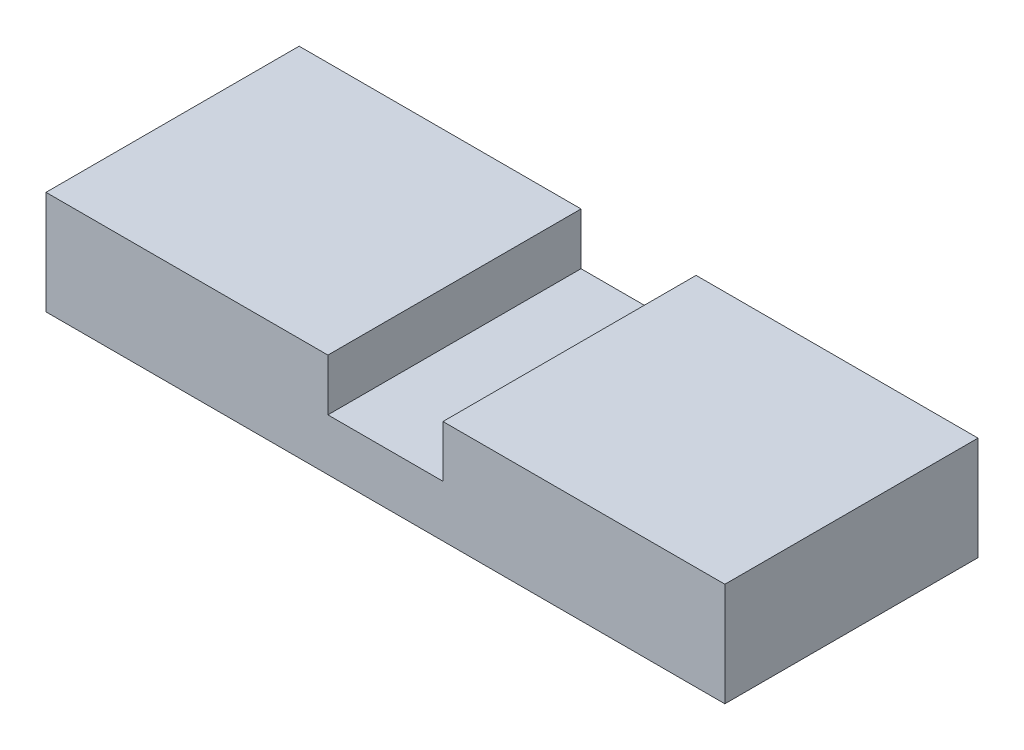
ISO-10303-21;
HEADER;
FILE_DESCRIPTION(('STEP AP214'),'2;1');
FILE_NAME('part.step','',(''),(''),'','','');
FILE_SCHEMA(('AUTOMOTIVE_DESIGN { 1 0 10303 214 1 1 1 1 }'));
ENDSEC;
DATA;
#1=APPLICATION_CONTEXT('core data for automotive mechanical design processes');
#2=APPLICATION_PROTOCOL_DEFINITION('international standard','automotive_design',2000,#1);
#3=PRODUCT_CONTEXT('',#1,'mechanical');
#4=PRODUCT('Part','Part','',(#3));
#5=PRODUCT_RELATED_PRODUCT_CATEGORY('part','',(#4));
#6=PRODUCT_DEFINITION_FORMATION('','',#4);
#7=PRODUCT_DEFINITION_CONTEXT('part definition',#1,'design');
#8=PRODUCT_DEFINITION('design','',#6,#7);
#9=PRODUCT_DEFINITION_SHAPE('','',#8);
#10=(LENGTH_UNIT() NAMED_UNIT(*) SI_UNIT(.MILLI.,.METRE.));
#11=(NAMED_UNIT(*) PLANE_ANGLE_UNIT() SI_UNIT($,.RADIAN.));
#12=(NAMED_UNIT(*) SI_UNIT($,.STERADIAN.) SOLID_ANGLE_UNIT());
#13=UNCERTAINTY_MEASURE_WITH_UNIT(LENGTH_MEASURE(1.E-05),#10,'distance_accuracy_value','');
#14=(GEOMETRIC_REPRESENTATION_CONTEXT(3) GLOBAL_UNCERTAINTY_ASSIGNED_CONTEXT((#13)) GLOBAL_UNIT_ASSIGNED_CONTEXT((#10,
#11,#12)) REPRESENTATION_CONTEXT('',''));
#15=CARTESIAN_POINT('',(0.,0.,0.));
#16=DIRECTION('',(0.,0.,1.));
#17=DIRECTION('',(1.,0.,0.));
#18=AXIS2_PLACEMENT_3D('',#15,#16,#17);
#19=CARTESIAN_POINT('',(-59.,9.,-22.));
#20=DIRECTION('',(0.,1.,0.));
#21=DIRECTION('',(0.,0.,1.));
#22=AXIS2_PLACEMENT_3D('',#19,#20,#21);
#23=PLANE('',#22);
#24=DIRECTION('',(0.,0.,1.));
#25=VECTOR('',#24,1.);
#26=CARTESIAN_POINT('',(-10.,9.,22.));
#27=LINE('',#26,#25);
#28=CARTESIAN_POINT('',(-10.,9.,-22.));
#29=VERTEX_POINT('',#28);
#30=CARTESIAN_POINT('',(-10.,9.,22.));
#31=VERTEX_POINT('',#30);
#32=EDGE_CURVE('E109',#29,#31,#27,.T.);
#33=ORIENTED_EDGE('',*,*,#32,.F.);
#34=DIRECTION('',(-1.,0.,0.));
#35=VECTOR('',#34,1.);
#36=CARTESIAN_POINT('',(59.,9.,-22.));
#37=LINE('',#36,#35);
#38=CARTESIAN_POINT('',(-59.,9.,-22.));
#39=VERTEX_POINT('',#38);
#40=EDGE_CURVE('E54',#29,#39,#37,.T.);
#41=ORIENTED_EDGE('',*,*,#40,.T.);
#42=DIRECTION('',(0.,0.,1.));
#43=VECTOR('',#42,1.);
#44=CARTESIAN_POINT('',(-59.,9.,22.));
#45=LINE('',#44,#43);
#46=CARTESIAN_POINT('',(-59.,9.,22.));
#47=VERTEX_POINT('',#46);
#48=EDGE_CURVE('E138',#39,#47,#45,.T.);
#49=ORIENTED_EDGE('',*,*,#48,.T.);
#50=DIRECTION('',(1.,0.,0.));
#51=VECTOR('',#50,1.);
#52=CARTESIAN_POINT('',(59.,9.,22.));
#53=LINE('',#52,#51);
#54=EDGE_CURVE('E83',#47,#31,#53,.T.);
#55=ORIENTED_EDGE('',*,*,#54,.T.);
#56=EDGE_LOOP('',(#33,#41,#49,#55));
#57=FACE_BOUND('',#56,.T.);
#58=ADVANCED_FACE('F30',(#57),#23,.T.);
#59=CARTESIAN_POINT('',(-59.,9.,22.));
#60=DIRECTION('',(1.,0.,0.));
#61=DIRECTION('',(0.,0.,-1.));
#62=AXIS2_PLACEMENT_3D('',#59,#60,#61);
#63=PLANE('',#62);
#64=DIRECTION('',(0.,0.,1.));
#65=VECTOR('',#64,1.);
#66=CARTESIAN_POINT('',(-59.,-9.,22.));
#67=LINE('',#66,#65);
#68=CARTESIAN_POINT('',(-59.,-9.,-22.));
#69=VERTEX_POINT('',#68);
#70=CARTESIAN_POINT('',(-59.,-9.,22.));
#71=VERTEX_POINT('',#70);
#72=EDGE_CURVE('E133',#69,#71,#67,.T.);
#73=ORIENTED_EDGE('',*,*,#72,.T.);
#74=DIRECTION('',(0.,-1.,0.));
#75=VECTOR('',#74,1.);
#76=CARTESIAN_POINT('',(-59.,9.,22.));
#77=LINE('',#76,#75);
#78=EDGE_CURVE('E11',#47,#71,#77,.T.);
#79=ORIENTED_EDGE('',*,*,#78,.F.);
#80=ORIENTED_EDGE('',*,*,#48,.F.);
#81=DIRECTION('',(0.,-1.,0.));
#82=VECTOR('',#81,1.);
#83=CARTESIAN_POINT('',(-59.,9.,-22.));
#84=LINE('',#83,#82);
#85=EDGE_CURVE('E147',#39,#69,#84,.T.);
#86=ORIENTED_EDGE('',*,*,#85,.T.);
#87=EDGE_LOOP('',(#73,#79,#80,#86));
#88=FACE_BOUND('',#87,.T.);
#89=ADVANCED_FACE('F32',(#88),#63,.F.);
#90=CARTESIAN_POINT('',(59.,9.,22.));
#91=DIRECTION('',(0.,0.,-1.));
#92=DIRECTION('',(-1.,0.,0.));
#93=AXIS2_PLACEMENT_3D('',#90,#91,#92);
#94=PLANE('',#93);
#95=DIRECTION('',(1.,0.,0.));
#96=VECTOR('',#95,1.);
#97=CARTESIAN_POINT('',(10.,0.,22.));
#98=LINE('',#97,#96);
#99=CARTESIAN_POINT('',(-10.,0.,22.));
#100=VERTEX_POINT('',#99);
#101=CARTESIAN_POINT('',(10.,0.,22.));
#102=VERTEX_POINT('',#101);
#103=EDGE_CURVE('E117',#100,#102,#98,.T.);
#104=ORIENTED_EDGE('',*,*,#103,.F.);
#105=DIRECTION('',(0.,1.,0.));
#106=VECTOR('',#105,1.);
#107=CARTESIAN_POINT('',(-10.,0.,22.));
#108=LINE('',#107,#106);
#109=EDGE_CURVE('E104',#100,#31,#108,.T.);
#110=ORIENTED_EDGE('',*,*,#109,.T.);
#111=ORIENTED_EDGE('',*,*,#54,.F.);
#112=ORIENTED_EDGE('',*,*,#78,.T.);
#113=DIRECTION('',(1.,0.,0.));
#114=VECTOR('',#113,1.);
#115=CARTESIAN_POINT('',(59.,-9.,22.));
#116=LINE('',#115,#114);
#117=CARTESIAN_POINT('',(59.,-9.,22.));
#118=VERTEX_POINT('',#117);
#119=EDGE_CURVE('E150',#71,#118,#116,.T.);
#120=ORIENTED_EDGE('',*,*,#119,.T.);
#121=DIRECTION('',(0.,-1.,0.));
#122=VECTOR('',#121,1.);
#123=CARTESIAN_POINT('',(59.,9.,22.));
#124=LINE('',#123,#122);
#125=CARTESIAN_POINT('',(59.,9.,22.));
#126=VERTEX_POINT('',#125);
#127=EDGE_CURVE('E38',#126,#118,#124,.T.);
#128=ORIENTED_EDGE('',*,*,#127,.F.);
#129=CARTESIAN_POINT('',(10.,9.,22.));
#130=VERTEX_POINT('',#129);
#131=EDGE_CURVE('E140',#130,#126,#53,.T.);
#132=ORIENTED_EDGE('',*,*,#131,.F.);
#133=DIRECTION('',(0.,1.,0.));
#134=VECTOR('',#133,1.);
#135=CARTESIAN_POINT('',(10.,0.,22.));
#136=LINE('',#135,#134);
#137=EDGE_CURVE('E45',#102,#130,#136,.T.);
#138=ORIENTED_EDGE('',*,*,#137,.F.);
#139=EDGE_LOOP('',(#104,#110,#111,#112,#120,#128,#132,#138));
#140=FACE_BOUND('',#139,.T.);
#141=ADVANCED_FACE('F122',(#140),#94,.F.);
#142=CARTESIAN_POINT('',(59.,9.,22.));
#143=DIRECTION('',(-1.,0.,0.));
#144=DIRECTION('',(0.,0.,1.));
#145=AXIS2_PLACEMENT_3D('',#142,#143,#144);
#146=PLANE('',#145);
#147=DIRECTION('',(0.,0.,-1.));
#148=VECTOR('',#147,1.);
#149=CARTESIAN_POINT('',(59.,-9.,22.));
#150=LINE('',#149,#148);
#151=CARTESIAN_POINT('',(59.,-9.,-22.));
#152=VERTEX_POINT('',#151);
#153=EDGE_CURVE('E152',#118,#152,#150,.T.);
#154=ORIENTED_EDGE('',*,*,#153,.T.);
#155=DIRECTION('',(0.,-1.,0.));
#156=VECTOR('',#155,1.);
#157=CARTESIAN_POINT('',(59.,9.,-22.));
#158=LINE('',#157,#156);
#159=CARTESIAN_POINT('',(59.,9.,-22.));
#160=VERTEX_POINT('',#159);
#161=EDGE_CURVE('E156',#160,#152,#158,.T.);
#162=ORIENTED_EDGE('',*,*,#161,.F.);
#163=DIRECTION('',(0.,0.,-1.));
#164=VECTOR('',#163,1.);
#165=CARTESIAN_POINT('',(59.,9.,22.));
#166=LINE('',#165,#164);
#167=EDGE_CURVE('E142',#126,#160,#166,.T.);
#168=ORIENTED_EDGE('',*,*,#167,.F.);
#169=ORIENTED_EDGE('',*,*,#127,.T.);
#170=EDGE_LOOP('',(#154,#162,#168,#169));
#171=FACE_BOUND('',#170,.T.);
#172=ADVANCED_FACE('F162',(#171),#146,.F.);
#173=CARTESIAN_POINT('',(59.,9.,-22.));
#174=DIRECTION('',(0.,0.,1.));
#175=DIRECTION('',(1.,0.,0.));
#176=AXIS2_PLACEMENT_3D('',#173,#174,#175);
#177=PLANE('',#176);
#178=ORIENTED_EDGE('',*,*,#40,.F.);
#179=DIRECTION('',(0.,1.,0.));
#180=VECTOR('',#179,1.);
#181=CARTESIAN_POINT('',(-10.,0.,-22.));
#182=LINE('',#181,#180);
#183=CARTESIAN_POINT('',(-10.,0.,-22.));
#184=VERTEX_POINT('',#183);
#185=EDGE_CURVE('E131',#184,#29,#182,.T.);
#186=ORIENTED_EDGE('',*,*,#185,.F.);
#187=DIRECTION('',(-1.,0.,0.));
#188=VECTOR('',#187,1.);
#189=CARTESIAN_POINT('',(10.,0.,-22.));
#190=LINE('',#189,#188);
#191=CARTESIAN_POINT('',(10.,0.,-22.));
#192=VERTEX_POINT('',#191);
#193=EDGE_CURVE('E111',#192,#184,#190,.T.);
#194=ORIENTED_EDGE('',*,*,#193,.F.);
#195=DIRECTION('',(0.,1.,0.));
#196=VECTOR('',#195,1.);
#197=CARTESIAN_POINT('',(10.,0.,-22.));
#198=LINE('',#197,#196);
#199=CARTESIAN_POINT('',(10.,9.,-22.));
#200=VERTEX_POINT('',#199);
#201=EDGE_CURVE('E134',#192,#200,#198,.T.);
#202=ORIENTED_EDGE('',*,*,#201,.T.);
#203=EDGE_CURVE('E144',#160,#200,#37,.T.);
#204=ORIENTED_EDGE('',*,*,#203,.F.);
#205=ORIENTED_EDGE('',*,*,#161,.T.);
#206=DIRECTION('',(-1.,0.,0.));
#207=VECTOR('',#206,1.);
#208=CARTESIAN_POINT('',(59.,-9.,-22.));
#209=LINE('',#208,#207);
#210=EDGE_CURVE('E76',#152,#69,#209,.T.);
#211=ORIENTED_EDGE('',*,*,#210,.T.);
#212=ORIENTED_EDGE('',*,*,#85,.F.);
#213=EDGE_LOOP('',(#178,#186,#194,#202,#204,#205,#211,#212));
#214=FACE_BOUND('',#213,.T.);
#215=ADVANCED_FACE('F170',(#214),#177,.F.);
#216=DIRECTION('',(0.,0.,-1.));
#217=VECTOR('',#216,1.);
#218=CARTESIAN_POINT('',(10.,9.,22.));
#219=LINE('',#218,#217);
#220=EDGE_CURVE('E120',#130,#200,#219,.T.);
#221=ORIENTED_EDGE('',*,*,#220,.F.);
#222=ORIENTED_EDGE('',*,*,#131,.T.);
#223=ORIENTED_EDGE('',*,*,#167,.T.);
#224=ORIENTED_EDGE('',*,*,#203,.T.);
#225=EDGE_LOOP('',(#221,#222,#223,#224));
#226=FACE_BOUND('',#225,.T.);
#227=ADVANCED_FACE('F173',(#226),#23,.T.);
#228=CARTESIAN_POINT('',(-59.,-9.,-22.));
#229=DIRECTION('',(0.,1.,0.));
#230=DIRECTION('',(0.,0.,1.));
#231=AXIS2_PLACEMENT_3D('',#228,#229,#230);
#232=PLANE('',#231);
#233=ORIENTED_EDGE('',*,*,#72,.F.);
#234=ORIENTED_EDGE('',*,*,#210,.F.);
#235=ORIENTED_EDGE('',*,*,#153,.F.);
#236=ORIENTED_EDGE('',*,*,#119,.F.);
#237=EDGE_LOOP('',(#233,#234,#235,#236));
#238=FACE_BOUND('',#237,.T.);
#239=ADVANCED_FACE('F166',(#238),#232,.F.);
#240=CARTESIAN_POINT('',(-10.,0.,22.));
#241=DIRECTION('',(-1.,0.,0.));
#242=DIRECTION('',(0.,0.,1.));
#243=AXIS2_PLACEMENT_3D('',#240,#241,#242);
#244=PLANE('',#243);
#245=ORIENTED_EDGE('',*,*,#32,.T.);
#246=ORIENTED_EDGE('',*,*,#109,.F.);
#247=DIRECTION('',(0.,0.,1.));
#248=VECTOR('',#247,1.);
#249=CARTESIAN_POINT('',(-10.,0.,22.));
#250=LINE('',#249,#248);
#251=EDGE_CURVE('E107',#184,#100,#250,.T.);
#252=ORIENTED_EDGE('',*,*,#251,.F.);
#253=ORIENTED_EDGE('',*,*,#185,.T.);
#254=EDGE_LOOP('',(#245,#246,#252,#253));
#255=FACE_BOUND('',#254,.T.);
#256=ADVANCED_FACE('F106',(#255),#244,.F.);
#257=CARTESIAN_POINT('',(10.,0.,22.));
#258=DIRECTION('',(1.,0.,0.));
#259=DIRECTION('',(0.,0.,-1.));
#260=AXIS2_PLACEMENT_3D('',#257,#258,#259);
#261=PLANE('',#260);
#262=ORIENTED_EDGE('',*,*,#220,.T.);
#263=ORIENTED_EDGE('',*,*,#201,.F.);
#264=DIRECTION('',(0.,0.,-1.));
#265=VECTOR('',#264,1.);
#266=CARTESIAN_POINT('',(10.,0.,22.));
#267=LINE('',#266,#265);
#268=EDGE_CURVE('E124',#102,#192,#267,.T.);
#269=ORIENTED_EDGE('',*,*,#268,.F.);
#270=ORIENTED_EDGE('',*,*,#137,.T.);
#271=EDGE_LOOP('',(#262,#263,#269,#270));
#272=FACE_BOUND('',#271,.T.);
#273=ADVANCED_FACE('F187',(#272),#261,.F.);
#274=CARTESIAN_POINT('',(-10.,0.,-22.));
#275=DIRECTION('',(0.,1.,0.));
#276=DIRECTION('',(0.,0.,1.));
#277=AXIS2_PLACEMENT_3D('',#274,#275,#276);
#278=PLANE('',#277);
#279=ORIENTED_EDGE('',*,*,#251,.T.);
#280=ORIENTED_EDGE('',*,*,#103,.T.);
#281=ORIENTED_EDGE('',*,*,#268,.T.);
#282=ORIENTED_EDGE('',*,*,#193,.T.);
#283=EDGE_LOOP('',(#279,#280,#281,#282));
#284=FACE_BOUND('',#283,.T.);
#285=ADVANCED_FACE('F115',(#284),#278,.T.);
#286=CLOSED_SHELL('',(#58,#89,#141,#172,#215,#227,#239,#256,#273,#285));
#287=MANIFOLD_SOLID_BREP('B2',#286);
#288=ADVANCED_BREP_SHAPE_REPRESENTATION('',(#18,#287),#14);
#289=SHAPE_DEFINITION_REPRESENTATION(#9,#288);
ENDSEC;
END-ISO-10303-21;
